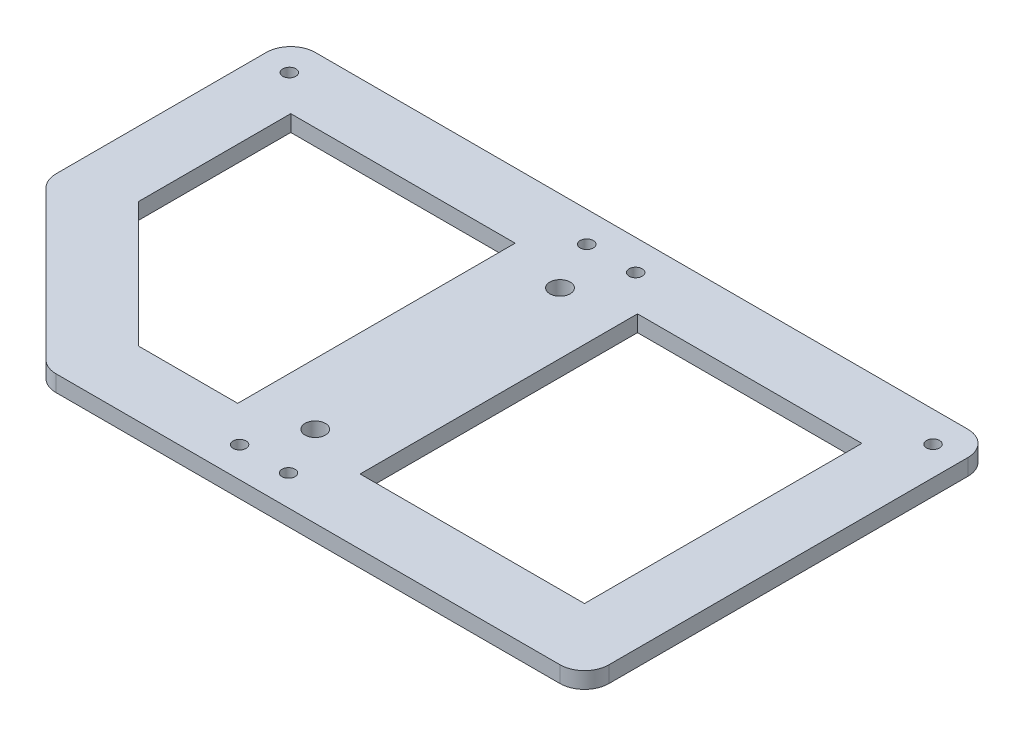
ISO-10303-21;
HEADER;
FILE_DESCRIPTION(('STEP AP214'),'2;1');
FILE_NAME('part.step','',(''),(''),'','','');
FILE_SCHEMA(('AUTOMOTIVE_DESIGN { 1 0 10303 214 1 1 1 1 }'));
ENDSEC;
DATA;
#1=APPLICATION_CONTEXT('core data for automotive mechanical design processes');
#2=APPLICATION_PROTOCOL_DEFINITION('international standard','automotive_design',2000,#1);
#3=PRODUCT_CONTEXT('',#1,'mechanical');
#4=PRODUCT('Part','Part','',(#3));
#5=PRODUCT_RELATED_PRODUCT_CATEGORY('part','',(#4));
#6=PRODUCT_DEFINITION_FORMATION('','',#4);
#7=PRODUCT_DEFINITION_CONTEXT('part definition',#1,'design');
#8=PRODUCT_DEFINITION('design','',#6,#7);
#9=PRODUCT_DEFINITION_SHAPE('','',#8);
#10=(LENGTH_UNIT() NAMED_UNIT(*) SI_UNIT(.MILLI.,.METRE.));
#11=(NAMED_UNIT(*) PLANE_ANGLE_UNIT() SI_UNIT($,.RADIAN.));
#12=(NAMED_UNIT(*) SI_UNIT($,.STERADIAN.) SOLID_ANGLE_UNIT());
#13=UNCERTAINTY_MEASURE_WITH_UNIT(LENGTH_MEASURE(1.E-05),#10,'distance_accuracy_value','');
#14=(GEOMETRIC_REPRESENTATION_CONTEXT(3) GLOBAL_UNCERTAINTY_ASSIGNED_CONTEXT((#13)) GLOBAL_UNIT_ASSIGNED_CONTEXT((#10,
#11,#12)) REPRESENTATION_CONTEXT('',''));
#15=CARTESIAN_POINT('',(0.,0.,0.));
#16=DIRECTION('',(0.,0.,1.));
#17=DIRECTION('',(1.,0.,0.));
#18=AXIS2_PLACEMENT_3D('',#15,#16,#17);
#19=CARTESIAN_POINT('',(0.,2.,0.));
#20=DIRECTION('',(0.,1.,0.));
#21=DIRECTION('',(0.,0.,1.));
#22=AXIS2_PLACEMENT_3D('',#19,#20,#21);
#23=PLANE('',#22);
#24=DIRECTION('',(1.,0.,0.));
#25=VECTOR('',#24,1.);
#26=CARTESIAN_POINT('',(-7.5,2.,17.));
#27=LINE('',#26,#25);
#28=CARTESIAN_POINT('',(-19.6862915010152,2.,17.));
#29=VERTEX_POINT('',#28);
#30=CARTESIAN_POINT('',(-7.5,2.,17.));
#31=VERTEX_POINT('',#30);
#32=EDGE_CURVE('E198',#29,#31,#27,.T.);
#33=ORIENTED_EDGE('',*,*,#32,.F.);
#34=DIRECTION('',(-0.707106781186548,0.,-0.707106781186547));
#35=VECTOR('',#34,1.);
#36=CARTESIAN_POINT('',(-19.6862915010152,2.,17.));
#37=LINE('',#36,#35);
#38=CARTESIAN_POINT('',(-35.,2.,1.68629150101525));
#39=VERTEX_POINT('',#38);
#40=EDGE_CURVE('E371',#29,#39,#37,.T.);
#41=ORIENTED_EDGE('',*,*,#40,.T.);
#42=DIRECTION('',(0.,0.,1.));
#43=VECTOR('',#42,1.);
#44=CARTESIAN_POINT('',(-35.,2.,17.));
#45=LINE('',#44,#43);
#46=CARTESIAN_POINT('',(-35.,2.,-17.));
#47=VERTEX_POINT('',#46);
#48=EDGE_CURVE('E196',#47,#39,#45,.T.);
#49=ORIENTED_EDGE('',*,*,#48,.F.);
#50=DIRECTION('',(-1.,0.,0.));
#51=VECTOR('',#50,1.);
#52=CARTESIAN_POINT('',(-7.5,2.,-17.));
#53=LINE('',#52,#51);
#54=CARTESIAN_POINT('',(-7.5,2.,-17.));
#55=VERTEX_POINT('',#54);
#56=EDGE_CURVE('E182',#55,#47,#53,.T.);
#57=ORIENTED_EDGE('',*,*,#56,.F.);
#58=DIRECTION('',(0.,0.,-1.));
#59=VECTOR('',#58,1.);
#60=CARTESIAN_POINT('',(-7.5,2.,17.));
#61=LINE('',#60,#59);
#62=EDGE_CURVE('E171',#31,#55,#61,.T.);
#63=ORIENTED_EDGE('',*,*,#62,.F.);
#64=EDGE_LOOP('',(#33,#41,#49,#57,#63));
#65=FACE_BOUND('',#64,.T.);
#66=DIRECTION('',(0.,0.,1.));
#67=VECTOR('',#66,1.);
#68=CARTESIAN_POINT('',(-43.,2.,-25.));
#69=LINE('',#68,#67);
#70=CARTESIAN_POINT('',(-43.,2.,-22.));
#71=VERTEX_POINT('',#70);
#72=CARTESIAN_POINT('',(-43.,2.,3.75735931288073));
#73=VERTEX_POINT('',#72);
#74=EDGE_CURVE('E288',#71,#73,#69,.T.);
#75=ORIENTED_EDGE('',*,*,#74,.T.);
#76=CARTESIAN_POINT('',(-40.,2.,3.75735931288073));
#77=DIRECTION('',(0.,1.,0.));
#78=DIRECTION('',(0.,0.,1.));
#79=AXIS2_PLACEMENT_3D('',#76,#77,#78);
#80=CIRCLE('',#79,3.);
#81=CARTESIAN_POINT('',(-42.1213203435596,2.,5.87867965644038));
#82=VERTEX_POINT('',#81);
#83=EDGE_CURVE('E347',#73,#82,#80,.T.);
#84=ORIENTED_EDGE('',*,*,#83,.T.);
#85=DIRECTION('',(0.707106781186548,0.,0.707106781186547));
#86=VECTOR('',#85,1.);
#87=CARTESIAN_POINT('',(-43.,2.,5.00000000000001));
#88=LINE('',#87,#86);
#89=CARTESIAN_POINT('',(-23.8786796564403,2.,24.1213203435597));
#90=VERTEX_POINT('',#89);
#91=EDGE_CURVE('E368',#82,#90,#88,.T.);
#92=ORIENTED_EDGE('',*,*,#91,.T.);
#93=CARTESIAN_POINT('',(-21.7573593128807,2.,22.));
#94=DIRECTION('',(0.,1.,0.));
#95=DIRECTION('',(0.,0.,1.));
#96=AXIS2_PLACEMENT_3D('',#93,#94,#95);
#97=CIRCLE('',#96,3.);
#98=CARTESIAN_POINT('',(-21.7573593128807,2.,25.));
#99=VERTEX_POINT('',#98);
#100=EDGE_CURVE('E345',#90,#99,#97,.T.);
#101=ORIENTED_EDGE('',*,*,#100,.T.);
#102=DIRECTION('',(1.,0.,0.));
#103=VECTOR('',#102,1.);
#104=CARTESIAN_POINT('',(-43.,2.,25.));
#105=LINE('',#104,#103);
#106=CARTESIAN_POINT('',(40.,2.,25.));
#107=VERTEX_POINT('',#106);
#108=EDGE_CURVE('E291',#99,#107,#105,.T.);
#109=ORIENTED_EDGE('',*,*,#108,.T.);
#110=CARTESIAN_POINT('',(40.,2.,22.));
#111=DIRECTION('',(0.,1.,0.));
#112=DIRECTION('',(0.,0.,1.));
#113=AXIS2_PLACEMENT_3D('',#110,#111,#112);
#114=CIRCLE('',#113,3.);
#115=CARTESIAN_POINT('',(43.,2.,22.));
#116=VERTEX_POINT('',#115);
#117=EDGE_CURVE('E328',#107,#116,#114,.T.);
#118=ORIENTED_EDGE('',*,*,#117,.T.);
#119=DIRECTION('',(0.,0.,-1.));
#120=VECTOR('',#119,1.);
#121=CARTESIAN_POINT('',(43.,2.,-25.));
#122=LINE('',#121,#120);
#123=CARTESIAN_POINT('',(43.,2.,-22.));
#124=VERTEX_POINT('',#123);
#125=EDGE_CURVE('E294',#116,#124,#122,.T.);
#126=ORIENTED_EDGE('',*,*,#125,.T.);
#127=CARTESIAN_POINT('',(40.,2.,-22.));
#128=DIRECTION('',(0.,1.,0.));
#129=DIRECTION('',(0.,0.,1.));
#130=AXIS2_PLACEMENT_3D('',#127,#128,#129);
#131=CIRCLE('',#130,3.);
#132=CARTESIAN_POINT('',(40.,2.,-25.));
#133=VERTEX_POINT('',#132);
#134=EDGE_CURVE('E330',#124,#133,#131,.T.);
#135=ORIENTED_EDGE('',*,*,#134,.T.);
#136=DIRECTION('',(-1.,0.,0.));
#137=VECTOR('',#136,1.);
#138=CARTESIAN_POINT('',(-43.,2.,-25.));
#139=LINE('',#138,#137);
#140=CARTESIAN_POINT('',(-40.,2.,-25.));
#141=VERTEX_POINT('',#140);
#142=EDGE_CURVE('E297',#133,#141,#139,.T.);
#143=ORIENTED_EDGE('',*,*,#142,.T.);
#144=CARTESIAN_POINT('',(-40.,2.,-22.));
#145=DIRECTION('',(0.,1.,0.));
#146=DIRECTION('',(0.,0.,1.));
#147=AXIS2_PLACEMENT_3D('',#144,#145,#146);
#148=CIRCLE('',#147,3.);
#149=EDGE_CURVE('E332',#141,#71,#148,.T.);
#150=ORIENTED_EDGE('',*,*,#149,.T.);
#151=EDGE_LOOP('',(#75,#84,#92,#101,#109,#118,#126,#135,#143,#150));
#152=FACE_BOUND('',#151,.T.);
#153=CARTESIAN_POINT('',(0.,2.,-15.));
#154=DIRECTION('',(0.,1.,0.));
#155=DIRECTION('',(0.,0.,1.));
#156=AXIS2_PLACEMENT_3D('',#153,#154,#155);
#157=CIRCLE('',#156,1.25);
#158=CARTESIAN_POINT('',(0.,2.,-13.75));
#159=VERTEX_POINT('',#158);
#160=EDGE_CURVE('E190',#159,#159,#157,.T.);
#161=ORIENTED_EDGE('',*,*,#160,.F.);
#162=EDGE_LOOP('',(#161));
#163=FACE_BOUND('',#162,.T.);
#164=CARTESIAN_POINT('',(0.,2.,15.));
#165=DIRECTION('',(0.,1.,0.));
#166=DIRECTION('',(0.,0.,1.));
#167=AXIS2_PLACEMENT_3D('',#164,#165,#166);
#168=CIRCLE('',#167,1.25);
#169=CARTESIAN_POINT('',(0.,2.,16.25));
#170=VERTEX_POINT('',#169);
#171=EDGE_CURVE('E247',#170,#170,#168,.T.);
#172=ORIENTED_EDGE('',*,*,#171,.F.);
#173=EDGE_LOOP('',(#172));
#174=FACE_BOUND('',#173,.T.);
#175=CARTESIAN_POINT('',(39.45,2.,-21.275));
#176=DIRECTION('',(0.,1.,0.));
#177=DIRECTION('',(0.,0.,1.));
#178=AXIS2_PLACEMENT_3D('',#175,#176,#177);
#179=CIRCLE('',#178,0.800000000000002);
#180=CARTESIAN_POINT('',(39.45,2.,-20.475));
#181=VERTEX_POINT('',#180);
#182=EDGE_CURVE('E251',#181,#181,#179,.T.);
#183=ORIENTED_EDGE('',*,*,#182,.F.);
#184=EDGE_LOOP('',(#183));
#185=FACE_BOUND('',#184,.T.);
#186=CARTESIAN_POINT('',(3.,2.,-21.275));
#187=DIRECTION('',(0.,1.,0.));
#188=DIRECTION('',(0.,0.,1.));
#189=AXIS2_PLACEMENT_3D('',#186,#187,#188);
#190=CIRCLE('',#189,0.799999999999999);
#191=CARTESIAN_POINT('',(3.,2.,-20.475));
#192=VERTEX_POINT('',#191);
#193=EDGE_CURVE('E257',#192,#192,#190,.T.);
#194=ORIENTED_EDGE('',*,*,#193,.F.);
#195=EDGE_LOOP('',(#194));
#196=FACE_BOUND('',#195,.T.);
#197=CARTESIAN_POINT('',(3.,2.,21.275));
#198=DIRECTION('',(0.,1.,0.));
#199=DIRECTION('',(0.,0.,1.));
#200=AXIS2_PLACEMENT_3D('',#197,#198,#199);
#201=CIRCLE('',#200,0.799999999999999);
#202=CARTESIAN_POINT('',(3.,2.,22.075));
#203=VERTEX_POINT('',#202);
#204=EDGE_CURVE('E263',#203,#203,#201,.T.);
#205=ORIENTED_EDGE('',*,*,#204,.F.);
#206=EDGE_LOOP('',(#205));
#207=FACE_BOUND('',#206,.T.);
#208=CARTESIAN_POINT('',(-39.45,2.,-21.275));
#209=DIRECTION('',(0.,1.,0.));
#210=DIRECTION('',(0.,0.,1.));
#211=AXIS2_PLACEMENT_3D('',#208,#209,#210);
#212=CIRCLE('',#211,0.800000000000002);
#213=CARTESIAN_POINT('',(-39.45,2.,-20.475));
#214=VERTEX_POINT('',#213);
#215=EDGE_CURVE('E269',#214,#214,#212,.T.);
#216=ORIENTED_EDGE('',*,*,#215,.F.);
#217=EDGE_LOOP('',(#216));
#218=FACE_BOUND('',#217,.T.);
#219=CARTESIAN_POINT('',(-3.,2.,-21.275));
#220=DIRECTION('',(0.,1.,0.));
#221=DIRECTION('',(0.,0.,1.));
#222=AXIS2_PLACEMENT_3D('',#219,#220,#221);
#223=CIRCLE('',#222,0.799999999999999);
#224=CARTESIAN_POINT('',(-3.,2.,-20.475));
#225=VERTEX_POINT('',#224);
#226=EDGE_CURVE('E275',#225,#225,#223,.T.);
#227=ORIENTED_EDGE('',*,*,#226,.F.);
#228=EDGE_LOOP('',(#227));
#229=FACE_BOUND('',#228,.T.);
#230=CARTESIAN_POINT('',(-3.,2.,21.275));
#231=DIRECTION('',(0.,1.,0.));
#232=DIRECTION('',(0.,0.,1.));
#233=AXIS2_PLACEMENT_3D('',#230,#231,#232);
#234=CIRCLE('',#233,0.799999999999999);
#235=CARTESIAN_POINT('',(-3.,2.,22.075));
#236=VERTEX_POINT('',#235);
#237=EDGE_CURVE('E281',#236,#236,#234,.T.);
#238=ORIENTED_EDGE('',*,*,#237,.F.);
#239=EDGE_LOOP('',(#238));
#240=FACE_BOUND('',#239,.T.);
#241=DIRECTION('',(1.,0.,0.));
#242=VECTOR('',#241,1.);
#243=CARTESIAN_POINT('',(7.50000000000001,2.,17.));
#244=LINE('',#243,#242);
#245=CARTESIAN_POINT('',(7.50000000000001,2.,17.));
#246=VERTEX_POINT('',#245);
#247=CARTESIAN_POINT('',(35.,2.,17.));
#248=VERTEX_POINT('',#247);
#249=EDGE_CURVE('E215',#246,#248,#244,.T.);
#250=ORIENTED_EDGE('',*,*,#249,.F.);
#251=DIRECTION('',(0.,0.,1.));
#252=VECTOR('',#251,1.);
#253=CARTESIAN_POINT('',(7.5,2.,-17.));
#254=LINE('',#253,#252);
#255=CARTESIAN_POINT('',(7.5,2.,-17.));
#256=VERTEX_POINT('',#255);
#257=EDGE_CURVE('E213',#256,#246,#254,.T.);
#258=ORIENTED_EDGE('',*,*,#257,.F.);
#259=DIRECTION('',(-1.,0.,0.));
#260=VECTOR('',#259,1.);
#261=CARTESIAN_POINT('',(7.5,2.,-17.));
#262=LINE('',#261,#260);
#263=CARTESIAN_POINT('',(35.,2.,-17.));
#264=VERTEX_POINT('',#263);
#265=EDGE_CURVE('E221',#264,#256,#262,.T.);
#266=ORIENTED_EDGE('',*,*,#265,.F.);
#267=DIRECTION('',(0.,0.,-1.));
#268=VECTOR('',#267,1.);
#269=CARTESIAN_POINT('',(35.,2.,-17.));
#270=LINE('',#269,#268);
#271=EDGE_CURVE('E218',#248,#264,#270,.T.);
#272=ORIENTED_EDGE('',*,*,#271,.F.);
#273=EDGE_LOOP('',(#250,#258,#266,#272));
#274=FACE_BOUND('',#273,.T.);
#275=ADVANCED_FACE('F38',(#65,#152,#163,#174,#185,#196,#207,#218,#229,#240,#274),#23,.T.);
#276=CARTESIAN_POINT('',(0.,0.,0.));
#277=DIRECTION('',(0.,1.,0.));
#278=DIRECTION('',(0.,0.,1.));
#279=AXIS2_PLACEMENT_3D('',#276,#277,#278);
#280=PLANE('',#279);
#281=DIRECTION('',(0.,0.,1.));
#282=VECTOR('',#281,1.);
#283=CARTESIAN_POINT('',(-35.,0.,17.));
#284=LINE('',#283,#282);
#285=CARTESIAN_POINT('',(-35.,0.,-17.));
#286=VERTEX_POINT('',#285);
#287=CARTESIAN_POINT('',(-35.,0.,1.68629150101525));
#288=VERTEX_POINT('',#287);
#289=EDGE_CURVE('E207',#286,#288,#284,.T.);
#290=ORIENTED_EDGE('',*,*,#289,.T.);
#291=DIRECTION('',(0.707106781186548,0.,0.707106781186547));
#292=VECTOR('',#291,1.);
#293=CARTESIAN_POINT('',(-19.6862915010152,0.,17.));
#294=LINE('',#293,#292);
#295=CARTESIAN_POINT('',(-19.6862915010152,0.,17.));
#296=VERTEX_POINT('',#295);
#297=EDGE_CURVE('E376',#288,#296,#294,.T.);
#298=ORIENTED_EDGE('',*,*,#297,.T.);
#299=DIRECTION('',(1.,0.,0.));
#300=VECTOR('',#299,1.);
#301=CARTESIAN_POINT('',(-7.5,0.,17.));
#302=LINE('',#301,#300);
#303=CARTESIAN_POINT('',(-7.5,0.,17.));
#304=VERTEX_POINT('',#303);
#305=EDGE_CURVE('E183',#296,#304,#302,.T.);
#306=ORIENTED_EDGE('',*,*,#305,.T.);
#307=DIRECTION('',(0.,0.,-1.));
#308=VECTOR('',#307,1.);
#309=CARTESIAN_POINT('',(-7.5,0.,17.));
#310=LINE('',#309,#308);
#311=CARTESIAN_POINT('',(-7.5,0.,-17.));
#312=VERTEX_POINT('',#311);
#313=EDGE_CURVE('E203',#304,#312,#310,.T.);
#314=ORIENTED_EDGE('',*,*,#313,.T.);
#315=DIRECTION('',(-1.,0.,0.));
#316=VECTOR('',#315,1.);
#317=CARTESIAN_POINT('',(-7.5,0.,-17.));
#318=LINE('',#317,#316);
#319=EDGE_CURVE('E189',#312,#286,#318,.T.);
#320=ORIENTED_EDGE('',*,*,#319,.T.);
#321=EDGE_LOOP('',(#290,#298,#306,#314,#320));
#322=FACE_BOUND('',#321,.T.);
#323=DIRECTION('',(-0.707106781186548,0.,-0.707106781186547));
#324=VECTOR('',#323,1.);
#325=CARTESIAN_POINT('',(-43.,0.,5.00000000000001));
#326=LINE('',#325,#324);
#327=CARTESIAN_POINT('',(-23.8786796564403,0.,24.1213203435597));
#328=VERTEX_POINT('',#327);
#329=CARTESIAN_POINT('',(-42.1213203435596,0.,5.87867965644038));
#330=VERTEX_POINT('',#329);
#331=EDGE_CURVE('E228',#328,#330,#326,.T.);
#332=ORIENTED_EDGE('',*,*,#331,.T.);
#333=CARTESIAN_POINT('',(-40.,0.,3.75735931288073));
#334=DIRECTION('',(0.,1.,0.));
#335=DIRECTION('',(0.,0.,1.));
#336=AXIS2_PLACEMENT_3D('',#333,#334,#335);
#337=CIRCLE('',#336,3.);
#338=CARTESIAN_POINT('',(-43.,0.,3.75735931288073));
#339=VERTEX_POINT('',#338);
#340=EDGE_CURVE('E46',#330,#339,#337,.F.);
#341=ORIENTED_EDGE('',*,*,#340,.T.);
#342=DIRECTION('',(0.,0.,1.));
#343=VECTOR('',#342,1.);
#344=CARTESIAN_POINT('',(-43.,0.,-25.));
#345=LINE('',#344,#343);
#346=CARTESIAN_POINT('',(-43.,0.,-22.));
#347=VERTEX_POINT('',#346);
#348=EDGE_CURVE('E287',#347,#339,#345,.T.);
#349=ORIENTED_EDGE('',*,*,#348,.F.);
#350=CARTESIAN_POINT('',(-40.,0.,-22.));
#351=DIRECTION('',(0.,1.,0.));
#352=DIRECTION('',(0.,0.,1.));
#353=AXIS2_PLACEMENT_3D('',#350,#351,#352);
#354=CIRCLE('',#353,3.);
#355=CARTESIAN_POINT('',(-40.,0.,-25.));
#356=VERTEX_POINT('',#355);
#357=EDGE_CURVE('E321',#347,#356,#354,.F.);
#358=ORIENTED_EDGE('',*,*,#357,.T.);
#359=DIRECTION('',(-1.,0.,0.));
#360=VECTOR('',#359,1.);
#361=CARTESIAN_POINT('',(-43.,0.,-25.));
#362=LINE('',#361,#360);
#363=CARTESIAN_POINT('',(40.,0.,-25.));
#364=VERTEX_POINT('',#363);
#365=EDGE_CURVE('E292',#364,#356,#362,.T.);
#366=ORIENTED_EDGE('',*,*,#365,.F.);
#367=CARTESIAN_POINT('',(40.,0.,-22.));
#368=DIRECTION('',(0.,1.,0.));
#369=DIRECTION('',(0.,0.,1.));
#370=AXIS2_PLACEMENT_3D('',#367,#368,#369);
#371=CIRCLE('',#370,3.);
#372=CARTESIAN_POINT('',(43.,0.,-22.));
#373=VERTEX_POINT('',#372);
#374=EDGE_CURVE('E319',#364,#373,#371,.F.);
#375=ORIENTED_EDGE('',*,*,#374,.T.);
#376=DIRECTION('',(0.,0.,-1.));
#377=VECTOR('',#376,1.);
#378=CARTESIAN_POINT('',(43.,0.,-25.));
#379=LINE('',#378,#377);
#380=CARTESIAN_POINT('',(43.,0.,22.));
#381=VERTEX_POINT('',#380);
#382=EDGE_CURVE('E305',#381,#373,#379,.T.);
#383=ORIENTED_EDGE('',*,*,#382,.F.);
#384=CARTESIAN_POINT('',(40.,0.,22.));
#385=DIRECTION('',(0.,1.,0.));
#386=DIRECTION('',(0.,0.,1.));
#387=AXIS2_PLACEMENT_3D('',#384,#385,#386);
#388=CIRCLE('',#387,3.);
#389=CARTESIAN_POINT('',(40.,0.,25.));
#390=VERTEX_POINT('',#389);
#391=EDGE_CURVE('E316',#381,#390,#388,.F.);
#392=ORIENTED_EDGE('',*,*,#391,.T.);
#393=DIRECTION('',(1.,0.,0.));
#394=VECTOR('',#393,1.);
#395=CARTESIAN_POINT('',(-43.,0.,25.));
#396=LINE('',#395,#394);
#397=CARTESIAN_POINT('',(-21.7573593128807,0.,25.));
#398=VERTEX_POINT('',#397);
#399=EDGE_CURVE('E303',#398,#390,#396,.T.);
#400=ORIENTED_EDGE('',*,*,#399,.F.);
#401=CARTESIAN_POINT('',(-21.7573593128807,0.,22.));
#402=DIRECTION('',(0.,1.,0.));
#403=DIRECTION('',(0.,0.,1.));
#404=AXIS2_PLACEMENT_3D('',#401,#402,#403);
#405=CIRCLE('',#404,3.);
#406=EDGE_CURVE('E353',#398,#328,#405,.F.);
#407=ORIENTED_EDGE('',*,*,#406,.T.);
#408=EDGE_LOOP('',(#332,#341,#349,#358,#366,#375,#383,#392,#400,#407));
#409=FACE_BOUND('',#408,.T.);
#410=DIRECTION('',(0.,0.,1.));
#411=VECTOR('',#410,1.);
#412=CARTESIAN_POINT('',(7.5,0.,-17.));
#413=LINE('',#412,#411);
#414=CARTESIAN_POINT('',(7.5,0.,-17.));
#415=VERTEX_POINT('',#414);
#416=CARTESIAN_POINT('',(7.50000000000001,0.,17.));
#417=VERTEX_POINT('',#416);
#418=EDGE_CURVE('E224',#415,#417,#413,.T.);
#419=ORIENTED_EDGE('',*,*,#418,.T.);
#420=DIRECTION('',(1.,0.,0.));
#421=VECTOR('',#420,1.);
#422=CARTESIAN_POINT('',(7.50000000000001,0.,17.));
#423=LINE('',#422,#421);
#424=CARTESIAN_POINT('',(35.,0.,17.));
#425=VERTEX_POINT('',#424);
#426=EDGE_CURVE('E227',#417,#425,#423,.T.);
#427=ORIENTED_EDGE('',*,*,#426,.T.);
#428=DIRECTION('',(0.,0.,-1.));
#429=VECTOR('',#428,1.);
#430=CARTESIAN_POINT('',(35.,0.,-17.));
#431=LINE('',#430,#429);
#432=CARTESIAN_POINT('',(35.,0.,-17.));
#433=VERTEX_POINT('',#432);
#434=EDGE_CURVE('E231',#425,#433,#431,.T.);
#435=ORIENTED_EDGE('',*,*,#434,.T.);
#436=DIRECTION('',(-1.,0.,0.));
#437=VECTOR('',#436,1.);
#438=CARTESIAN_POINT('',(7.5,0.,-17.));
#439=LINE('',#438,#437);
#440=EDGE_CURVE('E216',#433,#415,#439,.T.);
#441=ORIENTED_EDGE('',*,*,#440,.T.);
#442=EDGE_LOOP('',(#419,#427,#435,#441));
#443=FACE_BOUND('',#442,.T.);
#444=CARTESIAN_POINT('',(0.,0.,-15.));
#445=DIRECTION('',(0.,1.,0.));
#446=DIRECTION('',(0.,0.,1.));
#447=AXIS2_PLACEMENT_3D('',#444,#445,#446);
#448=CIRCLE('',#447,1.25);
#449=CARTESIAN_POINT('',(0.,0.,-13.75));
#450=VERTEX_POINT('',#449);
#451=EDGE_CURVE('E246',#450,#450,#448,.T.);
#452=ORIENTED_EDGE('',*,*,#451,.T.);
#453=EDGE_LOOP('',(#452));
#454=FACE_BOUND('',#453,.T.);
#455=CARTESIAN_POINT('',(0.,0.,15.));
#456=DIRECTION('',(0.,1.,0.));
#457=DIRECTION('',(0.,0.,1.));
#458=AXIS2_PLACEMENT_3D('',#455,#456,#457);
#459=CIRCLE('',#458,1.25);
#460=CARTESIAN_POINT('',(0.,0.,16.25));
#461=VERTEX_POINT('',#460);
#462=EDGE_CURVE('E250',#461,#461,#459,.T.);
#463=ORIENTED_EDGE('',*,*,#462,.T.);
#464=EDGE_LOOP('',(#463));
#465=FACE_BOUND('',#464,.T.);
#466=CARTESIAN_POINT('',(39.45,0.,-21.275));
#467=DIRECTION('',(0.,1.,0.));
#468=DIRECTION('',(0.,0.,1.));
#469=AXIS2_PLACEMENT_3D('',#466,#467,#468);
#470=CIRCLE('',#469,0.800000000000002);
#471=CARTESIAN_POINT('',(39.45,0.,-20.475));
#472=VERTEX_POINT('',#471);
#473=EDGE_CURVE('E254',#472,#472,#470,.T.);
#474=ORIENTED_EDGE('',*,*,#473,.T.);
#475=EDGE_LOOP('',(#474));
#476=FACE_BOUND('',#475,.T.);
#477=CARTESIAN_POINT('',(3.,0.,-21.275));
#478=DIRECTION('',(0.,1.,0.));
#479=DIRECTION('',(0.,0.,1.));
#480=AXIS2_PLACEMENT_3D('',#477,#478,#479);
#481=CIRCLE('',#480,0.799999999999999);
#482=CARTESIAN_POINT('',(3.,0.,-20.475));
#483=VERTEX_POINT('',#482);
#484=EDGE_CURVE('E260',#483,#483,#481,.T.);
#485=ORIENTED_EDGE('',*,*,#484,.T.);
#486=EDGE_LOOP('',(#485));
#487=FACE_BOUND('',#486,.T.);
#488=CARTESIAN_POINT('',(3.,0.,21.275));
#489=DIRECTION('',(0.,1.,0.));
#490=DIRECTION('',(0.,0.,1.));
#491=AXIS2_PLACEMENT_3D('',#488,#489,#490);
#492=CIRCLE('',#491,0.799999999999999);
#493=CARTESIAN_POINT('',(3.,0.,22.075));
#494=VERTEX_POINT('',#493);
#495=EDGE_CURVE('E266',#494,#494,#492,.T.);
#496=ORIENTED_EDGE('',*,*,#495,.T.);
#497=EDGE_LOOP('',(#496));
#498=FACE_BOUND('',#497,.T.);
#499=CARTESIAN_POINT('',(-39.45,0.,-21.275));
#500=DIRECTION('',(0.,1.,0.));
#501=DIRECTION('',(0.,0.,1.));
#502=AXIS2_PLACEMENT_3D('',#499,#500,#501);
#503=CIRCLE('',#502,0.800000000000002);
#504=CARTESIAN_POINT('',(-39.45,0.,-20.475));
#505=VERTEX_POINT('',#504);
#506=EDGE_CURVE('E272',#505,#505,#503,.T.);
#507=ORIENTED_EDGE('',*,*,#506,.T.);
#508=EDGE_LOOP('',(#507));
#509=FACE_BOUND('',#508,.T.);
#510=CARTESIAN_POINT('',(-3.,0.,-21.275));
#511=DIRECTION('',(0.,1.,0.));
#512=DIRECTION('',(0.,0.,1.));
#513=AXIS2_PLACEMENT_3D('',#510,#511,#512);
#514=CIRCLE('',#513,0.799999999999999);
#515=CARTESIAN_POINT('',(-3.,0.,-20.475));
#516=VERTEX_POINT('',#515);
#517=EDGE_CURVE('E278',#516,#516,#514,.T.);
#518=ORIENTED_EDGE('',*,*,#517,.T.);
#519=EDGE_LOOP('',(#518));
#520=FACE_BOUND('',#519,.T.);
#521=CARTESIAN_POINT('',(-3.,0.,21.275));
#522=DIRECTION('',(0.,1.,0.));
#523=DIRECTION('',(0.,0.,1.));
#524=AXIS2_PLACEMENT_3D('',#521,#522,#523);
#525=CIRCLE('',#524,0.799999999999999);
#526=CARTESIAN_POINT('',(-3.,0.,22.075));
#527=VERTEX_POINT('',#526);
#528=EDGE_CURVE('E284',#527,#527,#525,.T.);
#529=ORIENTED_EDGE('',*,*,#528,.T.);
#530=EDGE_LOOP('',(#529));
#531=FACE_BOUND('',#530,.T.);
#532=ADVANCED_FACE('F357',(#322,#409,#443,#454,#465,#476,#487,#498,#509,#520,#531),#280,.F.);
#533=CARTESIAN_POINT('',(-43.,2.,-25.));
#534=DIRECTION('',(1.,0.,0.));
#535=DIRECTION('',(0.,0.,-1.));
#536=AXIS2_PLACEMENT_3D('',#533,#534,#535);
#537=PLANE('',#536);
#538=ORIENTED_EDGE('',*,*,#348,.T.);
#539=DIRECTION('',(0.,1.,0.));
#540=VECTOR('',#539,1.);
#541=CARTESIAN_POINT('',(-43.,2.,3.75735931288073));
#542=LINE('',#541,#540);
#543=EDGE_CURVE('E342',#339,#73,#542,.T.);
#544=ORIENTED_EDGE('',*,*,#543,.T.);
#545=ORIENTED_EDGE('',*,*,#74,.F.);
#546=DIRECTION('',(0.,-1.,0.));
#547=VECTOR('',#546,1.);
#548=CARTESIAN_POINT('',(-43.,2.,-22.));
#549=LINE('',#548,#547);
#550=EDGE_CURVE('E300',#71,#347,#549,.T.);
#551=ORIENTED_EDGE('',*,*,#550,.T.);
#552=EDGE_LOOP('',(#538,#544,#545,#551));
#553=FACE_BOUND('',#552,.T.);
#554=ADVANCED_FACE('F362',(#553),#537,.F.);
#555=CARTESIAN_POINT('',(-43.,2.,25.));
#556=DIRECTION('',(0.,0.,-1.));
#557=DIRECTION('',(-1.,0.,0.));
#558=AXIS2_PLACEMENT_3D('',#555,#556,#557);
#559=PLANE('',#558);
#560=ORIENTED_EDGE('',*,*,#108,.F.);
#561=DIRECTION('',(0.,1.,0.));
#562=VECTOR('',#561,1.);
#563=CARTESIAN_POINT('',(-21.7573593128807,0.,25.));
#564=LINE('',#563,#562);
#565=EDGE_CURVE('E11',#99,#398,#564,.F.);
#566=ORIENTED_EDGE('',*,*,#565,.T.);
#567=ORIENTED_EDGE('',*,*,#399,.T.);
#568=DIRECTION('',(0.,-1.,0.));
#569=VECTOR('',#568,1.);
#570=CARTESIAN_POINT('',(40.,2.,25.));
#571=LINE('',#570,#569);
#572=EDGE_CURVE('E339',#390,#107,#571,.F.);
#573=ORIENTED_EDGE('',*,*,#572,.T.);
#574=EDGE_LOOP('',(#560,#566,#567,#573));
#575=FACE_BOUND('',#574,.T.);
#576=ADVANCED_FACE('F422',(#575),#559,.F.);
#577=CARTESIAN_POINT('',(43.,2.,-25.));
#578=DIRECTION('',(-1.,0.,0.));
#579=DIRECTION('',(0.,0.,1.));
#580=AXIS2_PLACEMENT_3D('',#577,#578,#579);
#581=PLANE('',#580);
#582=ORIENTED_EDGE('',*,*,#382,.T.);
#583=DIRECTION('',(0.,-1.,0.));
#584=VECTOR('',#583,1.);
#585=CARTESIAN_POINT('',(43.,2.,-22.));
#586=LINE('',#585,#584);
#587=EDGE_CURVE('E337',#373,#124,#586,.F.);
#588=ORIENTED_EDGE('',*,*,#587,.T.);
#589=ORIENTED_EDGE('',*,*,#125,.F.);
#590=DIRECTION('',(0.,-1.,0.));
#591=VECTOR('',#590,1.);
#592=CARTESIAN_POINT('',(43.,2.,22.));
#593=LINE('',#592,#591);
#594=EDGE_CURVE('E334',#116,#381,#593,.T.);
#595=ORIENTED_EDGE('',*,*,#594,.T.);
#596=EDGE_LOOP('',(#582,#588,#589,#595));
#597=FACE_BOUND('',#596,.T.);
#598=ADVANCED_FACE('F418',(#597),#581,.F.);
#599=CARTESIAN_POINT('',(-43.,2.,-25.));
#600=DIRECTION('',(0.,0.,1.));
#601=DIRECTION('',(1.,0.,0.));
#602=AXIS2_PLACEMENT_3D('',#599,#600,#601);
#603=PLANE('',#602);
#604=ORIENTED_EDGE('',*,*,#365,.T.);
#605=DIRECTION('',(0.,-1.,0.));
#606=VECTOR('',#605,1.);
#607=CARTESIAN_POINT('',(-40.,2.,-25.));
#608=LINE('',#607,#606);
#609=EDGE_CURVE('E326',#356,#141,#608,.F.);
#610=ORIENTED_EDGE('',*,*,#609,.T.);
#611=ORIENTED_EDGE('',*,*,#142,.F.);
#612=DIRECTION('',(0.,-1.,0.));
#613=VECTOR('',#612,1.);
#614=CARTESIAN_POINT('',(40.,2.,-25.));
#615=LINE('',#614,#613);
#616=EDGE_CURVE('E323',#133,#364,#615,.T.);
#617=ORIENTED_EDGE('',*,*,#616,.T.);
#618=EDGE_LOOP('',(#604,#610,#611,#617));
#619=FACE_BOUND('',#618,.T.);
#620=ADVANCED_FACE('F415',(#619),#603,.F.);
#621=CARTESIAN_POINT('',(-3.,2.,21.275));
#622=DIRECTION('',(0.,1.,0.));
#623=DIRECTION('',(0.,0.,1.));
#624=AXIS2_PLACEMENT_3D('',#621,#622,#623);
#625=CYLINDRICAL_SURFACE('',#624,0.799999999999999);
#626=ORIENTED_EDGE('',*,*,#528,.F.);
#627=EDGE_LOOP('',(#626));
#628=FACE_BOUND('',#627,.T.);
#629=ORIENTED_EDGE('',*,*,#237,.T.);
#630=EDGE_LOOP('',(#629));
#631=FACE_BOUND('',#630,.T.);
#632=ADVANCED_FACE('F412',(#628,#631),#625,.F.);
#633=CARTESIAN_POINT('',(-3.,2.,-21.275));
#634=DIRECTION('',(0.,1.,0.));
#635=DIRECTION('',(0.,0.,1.));
#636=AXIS2_PLACEMENT_3D('',#633,#634,#635);
#637=CYLINDRICAL_SURFACE('',#636,0.799999999999999);
#638=ORIENTED_EDGE('',*,*,#517,.F.);
#639=EDGE_LOOP('',(#638));
#640=FACE_BOUND('',#639,.T.);
#641=ORIENTED_EDGE('',*,*,#226,.T.);
#642=EDGE_LOOP('',(#641));
#643=FACE_BOUND('',#642,.T.);
#644=ADVANCED_FACE('F599',(#640,#643),#637,.F.);
#645=CARTESIAN_POINT('',(-39.45,2.,-21.275));
#646=DIRECTION('',(0.,1.,0.));
#647=DIRECTION('',(0.,0.,1.));
#648=AXIS2_PLACEMENT_3D('',#645,#646,#647);
#649=CYLINDRICAL_SURFACE('',#648,0.800000000000002);
#650=ORIENTED_EDGE('',*,*,#506,.F.);
#651=EDGE_LOOP('',(#650));
#652=FACE_BOUND('',#651,.T.);
#653=ORIENTED_EDGE('',*,*,#215,.T.);
#654=EDGE_LOOP('',(#653));
#655=FACE_BOUND('',#654,.T.);
#656=ADVANCED_FACE('F588',(#652,#655),#649,.F.);
#657=CARTESIAN_POINT('',(3.,2.,21.275));
#658=DIRECTION('',(0.,1.,0.));
#659=DIRECTION('',(0.,0.,1.));
#660=AXIS2_PLACEMENT_3D('',#657,#658,#659);
#661=CYLINDRICAL_SURFACE('',#660,0.799999999999999);
#662=ORIENTED_EDGE('',*,*,#495,.F.);
#663=EDGE_LOOP('',(#662));
#664=FACE_BOUND('',#663,.T.);
#665=ORIENTED_EDGE('',*,*,#204,.T.);
#666=EDGE_LOOP('',(#665));
#667=FACE_BOUND('',#666,.T.);
#668=ADVANCED_FACE('F577',(#664,#667),#661,.F.);
#669=CARTESIAN_POINT('',(3.,2.,-21.275));
#670=DIRECTION('',(0.,1.,0.));
#671=DIRECTION('',(0.,0.,1.));
#672=AXIS2_PLACEMENT_3D('',#669,#670,#671);
#673=CYLINDRICAL_SURFACE('',#672,0.799999999999999);
#674=ORIENTED_EDGE('',*,*,#484,.F.);
#675=EDGE_LOOP('',(#674));
#676=FACE_BOUND('',#675,.T.);
#677=ORIENTED_EDGE('',*,*,#193,.T.);
#678=EDGE_LOOP('',(#677));
#679=FACE_BOUND('',#678,.T.);
#680=ADVANCED_FACE('F565',(#676,#679),#673,.F.);
#681=CARTESIAN_POINT('',(39.45,2.,-21.275));
#682=DIRECTION('',(0.,1.,0.));
#683=DIRECTION('',(0.,0.,1.));
#684=AXIS2_PLACEMENT_3D('',#681,#682,#683);
#685=CYLINDRICAL_SURFACE('',#684,0.800000000000002);
#686=ORIENTED_EDGE('',*,*,#473,.F.);
#687=EDGE_LOOP('',(#686));
#688=FACE_BOUND('',#687,.T.);
#689=ORIENTED_EDGE('',*,*,#182,.T.);
#690=EDGE_LOOP('',(#689));
#691=FACE_BOUND('',#690,.T.);
#692=ADVANCED_FACE('F554',(#688,#691),#685,.F.);
#693=CARTESIAN_POINT('',(0.,2.,15.));
#694=DIRECTION('',(0.,1.,0.));
#695=DIRECTION('',(0.,0.,1.));
#696=AXIS2_PLACEMENT_3D('',#693,#694,#695);
#697=CYLINDRICAL_SURFACE('',#696,1.25);
#698=ORIENTED_EDGE('',*,*,#171,.T.);
#699=EDGE_LOOP('',(#698));
#700=FACE_BOUND('',#699,.T.);
#701=ORIENTED_EDGE('',*,*,#462,.F.);
#702=EDGE_LOOP('',(#701));
#703=FACE_BOUND('',#702,.T.);
#704=ADVANCED_FACE('F543',(#700,#703),#697,.F.);
#705=CARTESIAN_POINT('',(0.,2.,-15.));
#706=DIRECTION('',(0.,1.,0.));
#707=DIRECTION('',(0.,0.,1.));
#708=AXIS2_PLACEMENT_3D('',#705,#706,#707);
#709=CYLINDRICAL_SURFACE('',#708,1.25);
#710=ORIENTED_EDGE('',*,*,#160,.T.);
#711=EDGE_LOOP('',(#710));
#712=FACE_BOUND('',#711,.T.);
#713=ORIENTED_EDGE('',*,*,#451,.F.);
#714=EDGE_LOOP('',(#713));
#715=FACE_BOUND('',#714,.T.);
#716=ADVANCED_FACE('F532',(#712,#715),#709,.F.);
#717=CARTESIAN_POINT('',(7.5,2.,-17.));
#718=DIRECTION('',(1.,0.,0.));
#719=DIRECTION('',(0.,0.,-1.));
#720=AXIS2_PLACEMENT_3D('',#717,#718,#719);
#721=PLANE('',#720);
#722=ORIENTED_EDGE('',*,*,#418,.F.);
#723=DIRECTION('',(0.,-1.,0.));
#724=VECTOR('',#723,1.);
#725=CARTESIAN_POINT('',(7.5,2.,-17.));
#726=LINE('',#725,#724);
#727=EDGE_CURVE('E223',#256,#415,#726,.T.);
#728=ORIENTED_EDGE('',*,*,#727,.F.);
#729=ORIENTED_EDGE('',*,*,#257,.T.);
#730=DIRECTION('',(0.,-1.,0.));
#731=VECTOR('',#730,1.);
#732=CARTESIAN_POINT('',(7.50000000000001,2.,17.));
#733=LINE('',#732,#731);
#734=EDGE_CURVE('E205',#246,#417,#733,.T.);
#735=ORIENTED_EDGE('',*,*,#734,.T.);
#736=EDGE_LOOP('',(#722,#728,#729,#735));
#737=FACE_BOUND('',#736,.T.);
#738=ADVANCED_FACE('F522',(#737),#721,.T.);
#739=CARTESIAN_POINT('',(7.50000000000001,2.,17.));
#740=DIRECTION('',(0.,0.,-1.));
#741=DIRECTION('',(-1.,0.,0.));
#742=AXIS2_PLACEMENT_3D('',#739,#740,#741);
#743=PLANE('',#742);
#744=ORIENTED_EDGE('',*,*,#426,.F.);
#745=ORIENTED_EDGE('',*,*,#734,.F.);
#746=ORIENTED_EDGE('',*,*,#249,.T.);
#747=DIRECTION('',(0.,-1.,0.));
#748=VECTOR('',#747,1.);
#749=CARTESIAN_POINT('',(35.,2.,17.));
#750=LINE('',#749,#748);
#751=EDGE_CURVE('E240',#248,#425,#750,.T.);
#752=ORIENTED_EDGE('',*,*,#751,.T.);
#753=EDGE_LOOP('',(#744,#745,#746,#752));
#754=FACE_BOUND('',#753,.T.);
#755=ADVANCED_FACE('F512',(#754),#743,.T.);
#756=CARTESIAN_POINT('',(35.,2.,-17.));
#757=DIRECTION('',(-1.,0.,0.));
#758=DIRECTION('',(0.,0.,1.));
#759=AXIS2_PLACEMENT_3D('',#756,#757,#758);
#760=PLANE('',#759);
#761=ORIENTED_EDGE('',*,*,#434,.F.);
#762=ORIENTED_EDGE('',*,*,#751,.F.);
#763=ORIENTED_EDGE('',*,*,#271,.T.);
#764=DIRECTION('',(0.,-1.,0.));
#765=VECTOR('',#764,1.);
#766=CARTESIAN_POINT('',(35.,2.,-17.));
#767=LINE('',#766,#765);
#768=EDGE_CURVE('E238',#264,#433,#767,.T.);
#769=ORIENTED_EDGE('',*,*,#768,.T.);
#770=EDGE_LOOP('',(#761,#762,#763,#769));
#771=FACE_BOUND('',#770,.T.);
#772=ADVANCED_FACE('F502',(#771),#760,.T.);
#773=CARTESIAN_POINT('',(7.5,2.,-17.));
#774=DIRECTION('',(0.,0.,1.));
#775=DIRECTION('',(1.,0.,0.));
#776=AXIS2_PLACEMENT_3D('',#773,#774,#775);
#777=PLANE('',#776);
#778=ORIENTED_EDGE('',*,*,#440,.F.);
#779=ORIENTED_EDGE('',*,*,#768,.F.);
#780=ORIENTED_EDGE('',*,*,#265,.T.);
#781=ORIENTED_EDGE('',*,*,#727,.T.);
#782=EDGE_LOOP('',(#778,#779,#780,#781));
#783=FACE_BOUND('',#782,.T.);
#784=ADVANCED_FACE('F493',(#783),#777,.T.);
#785=CARTESIAN_POINT('',(-7.5,2.,17.));
#786=DIRECTION('',(-1.,0.,0.));
#787=DIRECTION('',(0.,0.,1.));
#788=AXIS2_PLACEMENT_3D('',#785,#786,#787);
#789=PLANE('',#788);
#790=ORIENTED_EDGE('',*,*,#313,.F.);
#791=DIRECTION('',(0.,-1.,0.));
#792=VECTOR('',#791,1.);
#793=CARTESIAN_POINT('',(-7.5,2.,17.));
#794=LINE('',#793,#792);
#795=EDGE_CURVE('E178',#31,#304,#794,.T.);
#796=ORIENTED_EDGE('',*,*,#795,.F.);
#797=ORIENTED_EDGE('',*,*,#62,.T.);
#798=DIRECTION('',(0.,-1.,0.));
#799=VECTOR('',#798,1.);
#800=CARTESIAN_POINT('',(-7.5,2.,-17.));
#801=LINE('',#800,#799);
#802=EDGE_CURVE('E175',#55,#312,#801,.T.);
#803=ORIENTED_EDGE('',*,*,#802,.T.);
#804=EDGE_LOOP('',(#790,#796,#797,#803));
#805=FACE_BOUND('',#804,.T.);
#806=ADVANCED_FACE('F174',(#805),#789,.T.);
#807=CARTESIAN_POINT('',(-7.5,2.,-17.));
#808=DIRECTION('',(0.,0.,1.));
#809=DIRECTION('',(1.,0.,0.));
#810=AXIS2_PLACEMENT_3D('',#807,#808,#809);
#811=PLANE('',#810);
#812=ORIENTED_EDGE('',*,*,#319,.F.);
#813=ORIENTED_EDGE('',*,*,#802,.F.);
#814=ORIENTED_EDGE('',*,*,#56,.T.);
#815=DIRECTION('',(0.,-1.,0.));
#816=VECTOR('',#815,1.);
#817=CARTESIAN_POINT('',(-35.,2.,-17.));
#818=LINE('',#817,#816);
#819=EDGE_CURVE('E191',#47,#286,#818,.T.);
#820=ORIENTED_EDGE('',*,*,#819,.T.);
#821=EDGE_LOOP('',(#812,#813,#814,#820));
#822=FACE_BOUND('',#821,.T.);
#823=ADVANCED_FACE('F186',(#822),#811,.T.);
#824=CARTESIAN_POINT('',(-35.,2.,17.));
#825=DIRECTION('',(1.,0.,0.));
#826=DIRECTION('',(0.,0.,-1.));
#827=AXIS2_PLACEMENT_3D('',#824,#825,#826);
#828=PLANE('',#827);
#829=DIRECTION('',(0.,1.,0.));
#830=VECTOR('',#829,1.);
#831=CARTESIAN_POINT('',(-35.,-32.9705627484771,1.68629150101525));
#832=LINE('',#831,#830);
#833=EDGE_CURVE('E378',#288,#39,#832,.T.);
#834=ORIENTED_EDGE('',*,*,#833,.F.);
#835=ORIENTED_EDGE('',*,*,#289,.F.);
#836=ORIENTED_EDGE('',*,*,#819,.F.);
#837=ORIENTED_EDGE('',*,*,#48,.T.);
#838=EDGE_LOOP('',(#834,#835,#836,#837));
#839=FACE_BOUND('',#838,.T.);
#840=ADVANCED_FACE('F393',(#839),#828,.T.);
#841=CARTESIAN_POINT('',(-7.5,2.,17.));
#842=DIRECTION('',(0.,0.,-1.));
#843=DIRECTION('',(-1.,0.,0.));
#844=AXIS2_PLACEMENT_3D('',#841,#842,#843);
#845=PLANE('',#844);
#846=DIRECTION('',(0.,1.,0.));
#847=VECTOR('',#846,1.);
#848=CARTESIAN_POINT('',(-19.6862915010152,-32.9705627484771,17.));
#849=LINE('',#848,#847);
#850=EDGE_CURVE('E373',#296,#29,#849,.T.);
#851=ORIENTED_EDGE('',*,*,#850,.T.);
#852=ORIENTED_EDGE('',*,*,#32,.T.);
#853=ORIENTED_EDGE('',*,*,#795,.T.);
#854=ORIENTED_EDGE('',*,*,#305,.F.);
#855=EDGE_LOOP('',(#851,#852,#853,#854));
#856=FACE_BOUND('',#855,.T.);
#857=ADVANCED_FACE('F390',(#856),#845,.T.);
#858=CARTESIAN_POINT('',(-40.,2.,-22.));
#859=DIRECTION('',(0.,-1.,0.));
#860=DIRECTION('',(0.,0.,-1.));
#861=AXIS2_PLACEMENT_3D('',#858,#859,#860);
#862=CYLINDRICAL_SURFACE('',#861,3.);
#863=ORIENTED_EDGE('',*,*,#149,.F.);
#864=ORIENTED_EDGE('',*,*,#609,.F.);
#865=ORIENTED_EDGE('',*,*,#357,.F.);
#866=ORIENTED_EDGE('',*,*,#550,.F.);
#867=EDGE_LOOP('',(#863,#864,#865,#866));
#868=FACE_BOUND('',#867,.T.);
#869=ADVANCED_FACE('F392',(#868),#862,.T.);
#870=CARTESIAN_POINT('',(40.,2.,-22.));
#871=DIRECTION('',(0.,-1.,0.));
#872=DIRECTION('',(0.,0.,-1.));
#873=AXIS2_PLACEMENT_3D('',#870,#871,#872);
#874=CYLINDRICAL_SURFACE('',#873,3.);
#875=ORIENTED_EDGE('',*,*,#134,.F.);
#876=ORIENTED_EDGE('',*,*,#587,.F.);
#877=ORIENTED_EDGE('',*,*,#374,.F.);
#878=ORIENTED_EDGE('',*,*,#616,.F.);
#879=EDGE_LOOP('',(#875,#876,#877,#878));
#880=FACE_BOUND('',#879,.T.);
#881=ADVANCED_FACE('F399',(#880),#874,.T.);
#882=CARTESIAN_POINT('',(40.,2.,22.));
#883=DIRECTION('',(0.,-1.,0.));
#884=DIRECTION('',(0.,0.,-1.));
#885=AXIS2_PLACEMENT_3D('',#882,#883,#884);
#886=CYLINDRICAL_SURFACE('',#885,3.);
#887=ORIENTED_EDGE('',*,*,#117,.F.);
#888=ORIENTED_EDGE('',*,*,#572,.F.);
#889=ORIENTED_EDGE('',*,*,#391,.F.);
#890=ORIENTED_EDGE('',*,*,#594,.F.);
#891=EDGE_LOOP('',(#887,#888,#889,#890));
#892=FACE_BOUND('',#891,.T.);
#893=ADVANCED_FACE('F430',(#892),#886,.T.);
#894=CARTESIAN_POINT('',(-19.6862915010152,-32.9705627484771,17.));
#895=DIRECTION('',(0.707106781186547,0.,-0.707106781186548));
#896=DIRECTION('',(-0.707106781186548,0.,-0.707106781186547));
#897=AXIS2_PLACEMENT_3D('',#894,#895,#896);
#898=PLANE('',#897);
#899=ORIENTED_EDGE('',*,*,#297,.F.);
#900=ORIENTED_EDGE('',*,*,#833,.T.);
#901=ORIENTED_EDGE('',*,*,#40,.F.);
#902=ORIENTED_EDGE('',*,*,#850,.F.);
#903=EDGE_LOOP('',(#899,#900,#901,#902));
#904=FACE_BOUND('',#903,.T.);
#905=ADVANCED_FACE('F388',(#904),#898,.T.);
#906=CARTESIAN_POINT('',(-43.,-32.9705627484771,5.00000000000001));
#907=DIRECTION('',(-0.707106781186547,0.,0.707106781186548));
#908=DIRECTION('',(0.707106781186548,0.,0.707106781186547));
#909=AXIS2_PLACEMENT_3D('',#906,#907,#908);
#910=PLANE('',#909);
#911=ORIENTED_EDGE('',*,*,#91,.F.);
#912=DIRECTION('',(0.,1.,0.));
#913=VECTOR('',#912,1.);
#914=CARTESIAN_POINT('',(-42.1213203435596,0.,5.87867965644038));
#915=LINE('',#914,#913);
#916=EDGE_CURVE('E59',#82,#330,#915,.F.);
#917=ORIENTED_EDGE('',*,*,#916,.T.);
#918=ORIENTED_EDGE('',*,*,#331,.F.);
#919=DIRECTION('',(0.,1.,0.));
#920=VECTOR('',#919,1.);
#921=CARTESIAN_POINT('',(-23.8786796564403,2.,24.1213203435597));
#922=LINE('',#921,#920);
#923=EDGE_CURVE('E349',#328,#90,#922,.T.);
#924=ORIENTED_EDGE('',*,*,#923,.T.);
#925=EDGE_LOOP('',(#911,#917,#918,#924));
#926=FACE_BOUND('',#925,.T.);
#927=ADVANCED_FACE('F369',(#926),#910,.T.);
#928=CARTESIAN_POINT('',(-40.,2.,3.75735931288073));
#929=DIRECTION('',(0.,-1.,0.));
#930=DIRECTION('',(0.,0.,-1.));
#931=AXIS2_PLACEMENT_3D('',#928,#929,#930);
#932=CYLINDRICAL_SURFACE('',#931,3.);
#933=ORIENTED_EDGE('',*,*,#340,.F.);
#934=ORIENTED_EDGE('',*,*,#916,.F.);
#935=ORIENTED_EDGE('',*,*,#83,.F.);
#936=ORIENTED_EDGE('',*,*,#543,.F.);
#937=EDGE_LOOP('',(#933,#934,#935,#936));
#938=FACE_BOUND('',#937,.T.);
#939=ADVANCED_FACE('F365',(#938),#932,.T.);
#940=CARTESIAN_POINT('',(-21.7573593128807,-32.9705627484771,22.));
#941=DIRECTION('',(0.,-1.,0.));
#942=DIRECTION('',(0.,0.,-1.));
#943=AXIS2_PLACEMENT_3D('',#940,#941,#942);
#944=CYLINDRICAL_SURFACE('',#943,3.);
#945=ORIENTED_EDGE('',*,*,#406,.F.);
#946=ORIENTED_EDGE('',*,*,#565,.F.);
#947=ORIENTED_EDGE('',*,*,#100,.F.);
#948=ORIENTED_EDGE('',*,*,#923,.F.);
#949=EDGE_LOOP('',(#945,#946,#947,#948));
#950=FACE_BOUND('',#949,.T.);
#951=ADVANCED_FACE('F40',(#950),#944,.T.);
#952=CLOSED_SHELL('',(#275,#532,#554,#576,#598,#620,#632,#644,#656,#668,#680,#692,#704,#716,
#738,#755,#772,#784,#806,#823,#840,#857,#869,#881,#893,#905,#927,#939,#951));
#953=MANIFOLD_SOLID_BREP('B2',#952);
#954=ADVANCED_BREP_SHAPE_REPRESENTATION('',(#18,#953),#14);
#955=SHAPE_DEFINITION_REPRESENTATION(#9,#954);
ENDSEC;
END-ISO-10303-21;
